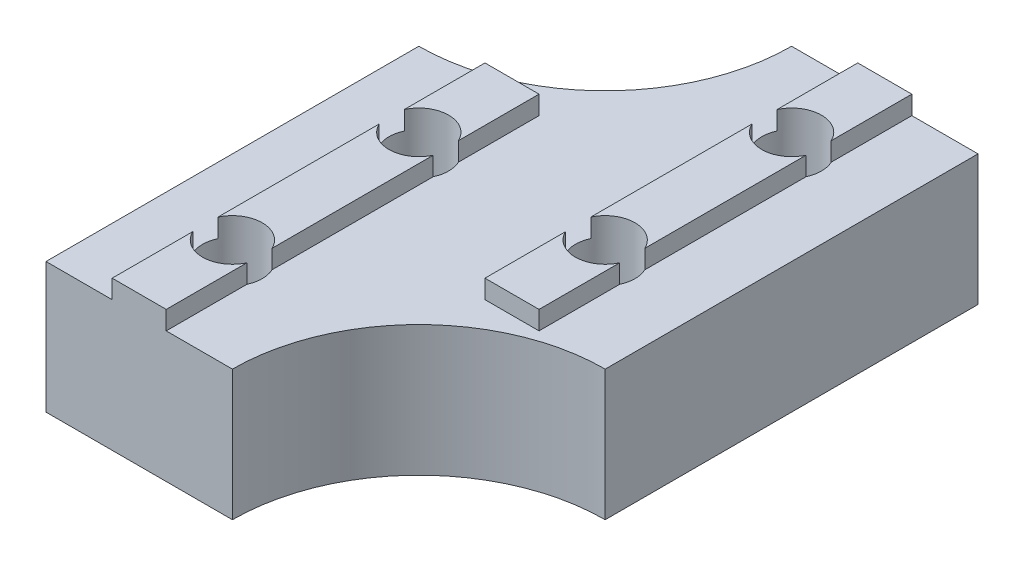
ISO-10303-21;
HEADER;
FILE_DESCRIPTION(('STEP AP214'),'2;1');
FILE_NAME('part.step','',(''),(''),'','','');
FILE_SCHEMA(('AUTOMOTIVE_DESIGN { 1 0 10303 214 1 1 1 1 }'));
ENDSEC;
DATA;
#1=APPLICATION_CONTEXT('core data for automotive mechanical design processes');
#2=APPLICATION_PROTOCOL_DEFINITION('international standard','automotive_design',2000,#1);
#3=PRODUCT_CONTEXT('',#1,'mechanical');
#4=PRODUCT('Part','Part','',(#3));
#5=PRODUCT_RELATED_PRODUCT_CATEGORY('part','',(#4));
#6=PRODUCT_DEFINITION_FORMATION('','',#4);
#7=PRODUCT_DEFINITION_CONTEXT('part definition',#1,'design');
#8=PRODUCT_DEFINITION('design','',#6,#7);
#9=PRODUCT_DEFINITION_SHAPE('','',#8);
#10=(LENGTH_UNIT() NAMED_UNIT(*) SI_UNIT(.MILLI.,.METRE.));
#11=(NAMED_UNIT(*) PLANE_ANGLE_UNIT() SI_UNIT($,.RADIAN.));
#12=(NAMED_UNIT(*) SI_UNIT($,.STERADIAN.) SOLID_ANGLE_UNIT());
#13=UNCERTAINTY_MEASURE_WITH_UNIT(LENGTH_MEASURE(1.E-05),#10,'distance_accuracy_value','');
#14=(GEOMETRIC_REPRESENTATION_CONTEXT(3) GLOBAL_UNCERTAINTY_ASSIGNED_CONTEXT((#13)) GLOBAL_UNIT_ASSIGNED_CONTEXT((#10,
#11,#12)) REPRESENTATION_CONTEXT('',''));
#15=CARTESIAN_POINT('',(0.,0.,0.));
#16=DIRECTION('',(0.,0.,1.));
#17=DIRECTION('',(1.,0.,0.));
#18=AXIS2_PLACEMENT_3D('',#15,#16,#17);
#19=CARTESIAN_POINT('',(-8.55,8.,10.));
#20=DIRECTION('',(-1.,0.,0.));
#21=DIRECTION('',(0.,-1.,0.));
#22=AXIS2_PLACEMENT_3D('',#19,#20,#21);
#23=PLANE('',#22);
#24=DIRECTION('',(0.,0.,-1.));
#25=VECTOR('',#24,1.);
#26=CARTESIAN_POINT('',(-8.55,7.,10.));
#27=LINE('',#26,#25);
#28=CARTESIAN_POINT('',(-8.55,7.,20.));
#29=VERTEX_POINT('',#28);
#30=CARTESIAN_POINT('',(-8.55,7.,15.6763874629234));
#31=VERTEX_POINT('',#30);
#32=EDGE_CURVE('E338',#29,#31,#27,.T.);
#33=ORIENTED_EDGE('',*,*,#32,.T.);
#34=DIRECTION('',(0.,1.,0.));
#35=VECTOR('',#34,1.);
#36=CARTESIAN_POINT('',(-8.55000000000001,0.,15.6763874629234));
#37=LINE('',#36,#35);
#38=CARTESIAN_POINT('',(-8.55,8.,15.6763874629234));
#39=VERTEX_POINT('',#38);
#40=EDGE_CURVE('E474',#31,#39,#37,.T.);
#41=ORIENTED_EDGE('',*,*,#40,.T.);
#42=DIRECTION('',(0.,0.,-1.));
#43=VECTOR('',#42,1.);
#44=CARTESIAN_POINT('',(-8.55,8.,10.));
#45=LINE('',#44,#43);
#46=CARTESIAN_POINT('',(-8.55,8.,20.));
#47=VERTEX_POINT('',#46);
#48=EDGE_CURVE('E333',#47,#39,#45,.T.);
#49=ORIENTED_EDGE('',*,*,#48,.F.);
#50=DIRECTION('',(0.,1.,0.));
#51=VECTOR('',#50,1.);
#52=CARTESIAN_POINT('',(-8.55,8.,20.));
#53=LINE('',#52,#51);
#54=EDGE_CURVE('E477',#29,#47,#53,.T.);
#55=ORIENTED_EDGE('',*,*,#54,.F.);
#56=EDGE_LOOP('',(#33,#41,#49,#55));
#57=FACE_BOUND('',#56,.T.);
#58=ADVANCED_FACE('F33',(#57),#23,.F.);
#59=CARTESIAN_POINT('',(-11.45,8.,10.));
#60=DIRECTION('',(0.,-1.,0.));
#61=DIRECTION('',(1.,0.,0.));
#62=AXIS2_PLACEMENT_3D('',#59,#60,#61);
#63=PLANE('',#62);
#64=ORIENTED_EDGE('',*,*,#48,.T.);
#65=CARTESIAN_POINT('',(-10.,8.,15.));
#66=DIRECTION('',(0.,1.,0.));
#67=DIRECTION('',(0.,0.,1.));
#68=AXIS2_PLACEMENT_3D('',#65,#66,#67);
#69=CIRCLE('',#68,1.6);
#70=CARTESIAN_POINT('',(-11.45,8.,15.6763874629234));
#71=VERTEX_POINT('',#70);
#72=EDGE_CURVE('E452',#71,#39,#69,.T.);
#73=ORIENTED_EDGE('',*,*,#72,.F.);
#74=DIRECTION('',(0.,0.,-1.));
#75=VECTOR('',#74,1.);
#76=CARTESIAN_POINT('',(-11.45,8.,10.));
#77=LINE('',#76,#75);
#78=CARTESIAN_POINT('',(-11.45,8.,20.));
#79=VERTEX_POINT('',#78);
#80=EDGE_CURVE('E328',#79,#71,#77,.T.);
#81=ORIENTED_EDGE('',*,*,#80,.F.);
#82=DIRECTION('',(-1.,0.,0.));
#83=VECTOR('',#82,1.);
#84=CARTESIAN_POINT('',(-11.45,8.,20.));
#85=LINE('',#84,#83);
#86=EDGE_CURVE('E480',#47,#79,#85,.T.);
#87=ORIENTED_EDGE('',*,*,#86,.F.);
#88=EDGE_LOOP('',(#64,#73,#81,#87));
#89=FACE_BOUND('',#88,.T.);
#90=ADVANCED_FACE('F547',(#89),#63,.F.);
#91=CARTESIAN_POINT('',(-11.45,7.,10.));
#92=DIRECTION('',(1.,0.,0.));
#93=DIRECTION('',(0.,0.,-1.));
#94=AXIS2_PLACEMENT_3D('',#91,#92,#93);
#95=PLANE('',#94);
#96=DIRECTION('',(0.,0.,-1.));
#97=VECTOR('',#96,1.);
#98=CARTESIAN_POINT('',(-11.45,7.,10.));
#99=LINE('',#98,#97);
#100=CARTESIAN_POINT('',(-11.45,7.,14.3236125370766));
#101=VERTEX_POINT('',#100);
#102=CARTESIAN_POINT('',(-11.45,7.,5.67638746292344));
#103=VERTEX_POINT('',#102);
#104=EDGE_CURVE('E327',#101,#103,#99,.T.);
#105=ORIENTED_EDGE('',*,*,#104,.F.);
#106=DIRECTION('',(0.,1.,0.));
#107=VECTOR('',#106,1.);
#108=CARTESIAN_POINT('',(-11.45,0.,14.3236125370766));
#109=LINE('',#108,#107);
#110=CARTESIAN_POINT('',(-11.45,8.,14.3236125370766));
#111=VERTEX_POINT('',#110);
#112=EDGE_CURVE('E56',#101,#111,#109,.T.);
#113=ORIENTED_EDGE('',*,*,#112,.T.);
#114=CARTESIAN_POINT('',(-11.45,8.,5.67638746292344));
#115=VERTEX_POINT('',#114);
#116=EDGE_CURVE('E332',#111,#115,#77,.T.);
#117=ORIENTED_EDGE('',*,*,#116,.T.);
#118=DIRECTION('',(0.,1.,0.));
#119=VECTOR('',#118,1.);
#120=CARTESIAN_POINT('',(-11.45,0.,5.67638746292344));
#121=LINE('',#120,#119);
#122=EDGE_CURVE('E500',#115,#103,#121,.F.);
#123=ORIENTED_EDGE('',*,*,#122,.T.);
#124=EDGE_LOOP('',(#105,#113,#117,#123));
#125=FACE_BOUND('',#124,.T.);
#126=ADVANCED_FACE('F564',(#125),#95,.F.);
#127=CARTESIAN_POINT('',(-8.55,8.,14.3236125370766));
#128=VERTEX_POINT('',#127);
#129=CARTESIAN_POINT('',(-8.55,8.,5.67638746292344));
#130=VERTEX_POINT('',#129);
#131=EDGE_CURVE('E337',#128,#130,#45,.T.);
#132=ORIENTED_EDGE('',*,*,#131,.F.);
#133=DIRECTION('',(0.,1.,0.));
#134=VECTOR('',#133,1.);
#135=CARTESIAN_POINT('',(-8.55000000000001,0.,14.3236125370766));
#136=LINE('',#135,#134);
#137=CARTESIAN_POINT('',(-8.55,7.,14.3236125370766));
#138=VERTEX_POINT('',#137);
#139=EDGE_CURVE('E471',#128,#138,#136,.F.);
#140=ORIENTED_EDGE('',*,*,#139,.T.);
#141=CARTESIAN_POINT('',(-8.55,7.,5.67638746292344));
#142=VERTEX_POINT('',#141);
#143=EDGE_CURVE('E342',#138,#142,#27,.T.);
#144=ORIENTED_EDGE('',*,*,#143,.T.);
#145=DIRECTION('',(0.,1.,0.));
#146=VECTOR('',#145,1.);
#147=CARTESIAN_POINT('',(-8.55000000000001,0.,5.67638746292345));
#148=LINE('',#147,#146);
#149=EDGE_CURVE('E392',#142,#130,#148,.T.);
#150=ORIENTED_EDGE('',*,*,#149,.T.);
#151=EDGE_LOOP('',(#132,#140,#144,#150));
#152=FACE_BOUND('',#151,.T.);
#153=ADVANCED_FACE('F538',(#152),#23,.F.);
#154=ORIENTED_EDGE('',*,*,#116,.F.);
#155=EDGE_CURVE('E454',#128,#111,#69,.T.);
#156=ORIENTED_EDGE('',*,*,#155,.F.);
#157=ORIENTED_EDGE('',*,*,#131,.T.);
#158=CARTESIAN_POINT('',(-10.,8.,5.));
#159=DIRECTION('',(0.,1.,0.));
#160=DIRECTION('',(0.,0.,1.));
#161=AXIS2_PLACEMENT_3D('',#158,#159,#160);
#162=CIRCLE('',#161,1.6);
#163=EDGE_CURVE('E496',#115,#130,#162,.T.);
#164=ORIENTED_EDGE('',*,*,#163,.F.);
#165=EDGE_LOOP('',(#154,#156,#157,#164));
#166=FACE_BOUND('',#165,.T.);
#167=ADVANCED_FACE('F534',(#166),#63,.F.);
#168=CARTESIAN_POINT('',(-11.45,8.,4.32361253707657));
#169=VERTEX_POINT('',#168);
#170=CARTESIAN_POINT('',(-11.45,8.,0.));
#171=VERTEX_POINT('',#170);
#172=EDGE_CURVE('E326',#169,#171,#77,.T.);
#173=ORIENTED_EDGE('',*,*,#172,.T.);
#174=DIRECTION('',(0.,-1.,0.));
#175=VECTOR('',#174,1.);
#176=CARTESIAN_POINT('',(-11.45,7.,0.));
#177=LINE('',#176,#175);
#178=CARTESIAN_POINT('',(-11.45,7.,0.));
#179=VERTEX_POINT('',#178);
#180=EDGE_CURVE('E456',#171,#179,#177,.T.);
#181=ORIENTED_EDGE('',*,*,#180,.T.);
#182=CARTESIAN_POINT('',(-11.45,7.,4.32361253707657));
#183=VERTEX_POINT('',#182);
#184=EDGE_CURVE('E322',#183,#179,#99,.T.);
#185=ORIENTED_EDGE('',*,*,#184,.F.);
#186=DIRECTION('',(0.,1.,0.));
#187=VECTOR('',#186,1.);
#188=CARTESIAN_POINT('',(-11.45,0.,4.32361253707657));
#189=LINE('',#188,#187);
#190=EDGE_CURVE('E506',#183,#169,#189,.T.);
#191=ORIENTED_EDGE('',*,*,#190,.T.);
#192=EDGE_LOOP('',(#173,#181,#185,#191));
#193=FACE_BOUND('',#192,.T.);
#194=ADVANCED_FACE('F565',(#193),#95,.F.);
#195=CARTESIAN_POINT('',(1.45,8.,10.));
#196=DIRECTION('',(-1.,0.,0.));
#197=DIRECTION('',(0.,-1.,0.));
#198=AXIS2_PLACEMENT_3D('',#195,#196,#197);
#199=PLANE('',#198);
#200=DIRECTION('',(0.,0.,-1.));
#201=VECTOR('',#200,1.);
#202=CARTESIAN_POINT('',(1.45,8.,10.));
#203=LINE('',#202,#201);
#204=CARTESIAN_POINT('',(1.45,7.99999999999999,10.));
#205=VERTEX_POINT('',#204);
#206=CARTESIAN_POINT('',(1.45,8.,5.67638746292344));
#207=VERTEX_POINT('',#206);
#208=EDGE_CURVE('E247',#205,#207,#203,.T.);
#209=ORIENTED_EDGE('',*,*,#208,.F.);
#210=DIRECTION('',(0.,-1.,0.));
#211=VECTOR('',#210,1.);
#212=CARTESIAN_POINT('',(1.45,8.,10.));
#213=LINE('',#212,#211);
#214=CARTESIAN_POINT('',(1.44999999999999,7.,10.));
#215=VERTEX_POINT('',#214);
#216=EDGE_CURVE('E232',#205,#215,#213,.T.);
#217=ORIENTED_EDGE('',*,*,#216,.T.);
#218=DIRECTION('',(0.,0.,-1.));
#219=VECTOR('',#218,1.);
#220=CARTESIAN_POINT('',(1.45,7.,10.));
#221=LINE('',#220,#219);
#222=CARTESIAN_POINT('',(1.45,7.,5.67638746292344));
#223=VERTEX_POINT('',#222);
#224=EDGE_CURVE('E245',#215,#223,#221,.T.);
#225=ORIENTED_EDGE('',*,*,#224,.T.);
#226=DIRECTION('',(0.,1.,0.));
#227=VECTOR('',#226,1.);
#228=CARTESIAN_POINT('',(1.44999999999999,0.,5.67638746292345));
#229=LINE('',#228,#227);
#230=EDGE_CURVE('E359',#223,#207,#229,.T.);
#231=ORIENTED_EDGE('',*,*,#230,.T.);
#232=EDGE_LOOP('',(#209,#217,#225,#231));
#233=FACE_BOUND('',#232,.T.);
#234=ADVANCED_FACE('F243',(#233),#199,.F.);
#235=CARTESIAN_POINT('',(-1.45,8.,10.));
#236=DIRECTION('',(0.,-1.,0.));
#237=DIRECTION('',(1.,0.,0.));
#238=AXIS2_PLACEMENT_3D('',#235,#236,#237);
#239=PLANE('',#238);
#240=DIRECTION('',(0.,0.,-1.));
#241=VECTOR('',#240,1.);
#242=CARTESIAN_POINT('',(-1.45,8.,10.));
#243=LINE('',#242,#241);
#244=CARTESIAN_POINT('',(-1.45,7.99999999999999,10.));
#245=VERTEX_POINT('',#244);
#246=CARTESIAN_POINT('',(-1.45,8.,5.67638746292344));
#247=VERTEX_POINT('',#246);
#248=EDGE_CURVE('E364',#245,#247,#243,.T.);
#249=ORIENTED_EDGE('',*,*,#248,.F.);
#250=DIRECTION('',(-1.,0.,0.));
#251=VECTOR('',#250,1.);
#252=CARTESIAN_POINT('',(5.,7.99999999999999,10.));
#253=LINE('',#252,#251);
#254=EDGE_CURVE('E239',#205,#245,#253,.T.);
#255=ORIENTED_EDGE('',*,*,#254,.F.);
#256=ORIENTED_EDGE('',*,*,#208,.T.);
#257=CARTESIAN_POINT('',(0.,8.,5.));
#258=DIRECTION('',(0.,1.,0.));
#259=DIRECTION('',(0.,0.,1.));
#260=AXIS2_PLACEMENT_3D('',#257,#258,#259);
#261=CIRCLE('',#260,1.6);
#262=EDGE_CURVE('E341',#247,#207,#261,.T.);
#263=ORIENTED_EDGE('',*,*,#262,.F.);
#264=EDGE_LOOP('',(#249,#255,#256,#263));
#265=FACE_BOUND('',#264,.T.);
#266=ADVANCED_FACE('F431',(#265),#239,.F.);
#267=CARTESIAN_POINT('',(-1.45,7.,10.));
#268=DIRECTION('',(1.,0.,0.));
#269=DIRECTION('',(0.,0.,-1.));
#270=AXIS2_PLACEMENT_3D('',#267,#268,#269);
#271=PLANE('',#270);
#272=DIRECTION('',(0.,0.,-1.));
#273=VECTOR('',#272,1.);
#274=CARTESIAN_POINT('',(-1.45,7.,10.));
#275=LINE('',#274,#273);
#276=CARTESIAN_POINT('',(-1.45,7.,4.32361253707657));
#277=VERTEX_POINT('',#276);
#278=CARTESIAN_POINT('',(-1.45,7.,-4.32361253707656));
#279=VERTEX_POINT('',#278);
#280=EDGE_CURVE('E361',#277,#279,#275,.T.);
#281=ORIENTED_EDGE('',*,*,#280,.F.);
#282=DIRECTION('',(0.,1.,0.));
#283=VECTOR('',#282,1.);
#284=CARTESIAN_POINT('',(-1.45,0.,4.32361253707657));
#285=LINE('',#284,#283);
#286=CARTESIAN_POINT('',(-1.45,8.,4.32361253707657));
#287=VERTEX_POINT('',#286);
#288=EDGE_CURVE('E352',#277,#287,#285,.T.);
#289=ORIENTED_EDGE('',*,*,#288,.T.);
#290=CARTESIAN_POINT('',(-1.45,8.,-4.32361253707656));
#291=VERTEX_POINT('',#290);
#292=EDGE_CURVE('E363',#287,#291,#243,.T.);
#293=ORIENTED_EDGE('',*,*,#292,.T.);
#294=DIRECTION('',(0.,1.,0.));
#295=VECTOR('',#294,1.);
#296=CARTESIAN_POINT('',(-1.45,0.,-4.32361253707656));
#297=LINE('',#296,#295);
#298=EDGE_CURVE('E375',#291,#279,#297,.F.);
#299=ORIENTED_EDGE('',*,*,#298,.T.);
#300=EDGE_LOOP('',(#281,#289,#293,#299));
#301=FACE_BOUND('',#300,.T.);
#302=ADVANCED_FACE('F374',(#301),#271,.F.);
#303=CARTESIAN_POINT('',(5.,0.,10.));
#304=DIRECTION('',(0.,1.,0.));
#305=DIRECTION('',(-1.,0.,0.));
#306=AXIS2_PLACEMENT_3D('',#303,#304,#305);
#307=PLANE('',#306);
#308=CARTESIAN_POINT('',(-10.,0.,15.));
#309=DIRECTION('',(0.,1.,0.));
#310=DIRECTION('',(0.,0.,1.));
#311=AXIS2_PLACEMENT_3D('',#308,#309,#310);
#312=CIRCLE('',#311,1.6);
#313=CARTESIAN_POINT('',(-10.,0.,16.6));
#314=VERTEX_POINT('',#313);
#315=EDGE_CURVE('E461',#314,#314,#312,.T.);
#316=ORIENTED_EDGE('',*,*,#315,.T.);
#317=EDGE_LOOP('',(#316));
#318=FACE_BOUND('',#317,.T.);
#319=CARTESIAN_POINT('',(-10.,0.,5.));
#320=DIRECTION('',(0.,1.,0.));
#321=DIRECTION('',(0.,0.,1.));
#322=AXIS2_PLACEMENT_3D('',#319,#320,#321);
#323=CIRCLE('',#322,1.6);
#324=CARTESIAN_POINT('',(-10.,0.,6.6));
#325=VERTEX_POINT('',#324);
#326=EDGE_CURVE('E497',#325,#325,#323,.T.);
#327=ORIENTED_EDGE('',*,*,#326,.T.);
#328=EDGE_LOOP('',(#327));
#329=FACE_BOUND('',#328,.T.);
#330=CARTESIAN_POINT('',(0.,0.,5.));
#331=DIRECTION('',(0.,1.,0.));
#332=DIRECTION('',(0.,0.,1.));
#333=AXIS2_PLACEMENT_3D('',#330,#331,#332);
#334=CIRCLE('',#333,1.6);
#335=CARTESIAN_POINT('',(0.,0.,6.6));
#336=VERTEX_POINT('',#335);
#337=EDGE_CURVE('E343',#336,#336,#334,.T.);
#338=ORIENTED_EDGE('',*,*,#337,.T.);
#339=EDGE_LOOP('',(#338));
#340=FACE_BOUND('',#339,.T.);
#341=DIRECTION('',(0.,0.,-1.));
#342=VECTOR('',#341,1.);
#343=CARTESIAN_POINT('',(5.,0.,10.));
#344=LINE('',#343,#342);
#345=CARTESIAN_POINT('',(5.,0.,10.));
#346=VERTEX_POINT('',#345);
#347=CARTESIAN_POINT('',(5.,0.,-10.));
#348=VERTEX_POINT('',#347);
#349=EDGE_CURVE('E257',#346,#348,#344,.T.);
#350=ORIENTED_EDGE('',*,*,#349,.F.);
#351=CARTESIAN_POINT('',(4.99999999999999,0.,20.));
#352=DIRECTION('',(0.,1.,0.));
#353=DIRECTION('',(-1.,0.,0.));
#354=AXIS2_PLACEMENT_3D('',#351,#352,#353);
#355=CIRCLE('',#354,10.);
#356=CARTESIAN_POINT('',(-5.00000000000001,0.,20.));
#357=VERTEX_POINT('',#356);
#358=EDGE_CURVE('E272',#346,#357,#355,.T.);
#359=ORIENTED_EDGE('',*,*,#358,.T.);
#360=DIRECTION('',(1.,0.,0.));
#361=VECTOR('',#360,1.);
#362=CARTESIAN_POINT('',(5.,0.,20.));
#363=LINE('',#362,#361);
#364=CARTESIAN_POINT('',(-15.,0.,20.));
#365=VERTEX_POINT('',#364);
#366=EDGE_CURVE('E492',#365,#357,#363,.T.);
#367=ORIENTED_EDGE('',*,*,#366,.F.);
#368=DIRECTION('',(0.,0.,-1.));
#369=VECTOR('',#368,1.);
#370=CARTESIAN_POINT('',(-15.,0.,10.));
#371=LINE('',#370,#369);
#372=CARTESIAN_POINT('',(-15.,0.,0.));
#373=VERTEX_POINT('',#372);
#374=EDGE_CURVE('E282',#365,#373,#371,.T.);
#375=ORIENTED_EDGE('',*,*,#374,.T.);
#376=CARTESIAN_POINT('',(-15.,0.,-10.));
#377=DIRECTION('',(0.,1.,0.));
#378=DIRECTION('',(-1.,0.,0.));
#379=AXIS2_PLACEMENT_3D('',#376,#377,#378);
#380=CIRCLE('',#379,10.);
#381=CARTESIAN_POINT('',(-5.,0.,-10.));
#382=VERTEX_POINT('',#381);
#383=EDGE_CURVE('E41',#373,#382,#380,.T.);
#384=ORIENTED_EDGE('',*,*,#383,.T.);
#385=DIRECTION('',(1.,0.,0.));
#386=VECTOR('',#385,1.);
#387=CARTESIAN_POINT('',(5.,0.,-10.));
#388=LINE('',#387,#386);
#389=EDGE_CURVE('E280',#382,#348,#388,.T.);
#390=ORIENTED_EDGE('',*,*,#389,.T.);
#391=EDGE_LOOP('',(#350,#359,#367,#375,#384,#390));
#392=FACE_BOUND('',#391,.T.);
#393=CARTESIAN_POINT('',(0.,0.,-5.));
#394=DIRECTION('',(0.,1.,0.));
#395=DIRECTION('',(0.,0.,1.));
#396=AXIS2_PLACEMENT_3D('',#393,#394,#395);
#397=CIRCLE('',#396,1.6);
#398=CARTESIAN_POINT('',(0.,0.,-3.4));
#399=VERTEX_POINT('',#398);
#400=EDGE_CURVE('E387',#399,#399,#397,.T.);
#401=ORIENTED_EDGE('',*,*,#400,.T.);
#402=EDGE_LOOP('',(#401));
#403=FACE_BOUND('',#402,.T.);
#404=ADVANCED_FACE('F278',(#318,#329,#340,#392,#403),#307,.F.);
#405=CARTESIAN_POINT('',(5.,7.,10.));
#406=DIRECTION('',(-1.,0.,0.));
#407=DIRECTION('',(0.,-1.,0.));
#408=AXIS2_PLACEMENT_3D('',#405,#406,#407);
#409=PLANE('',#408);
#410=DIRECTION('',(0.,0.,-1.));
#411=VECTOR('',#410,1.);
#412=CARTESIAN_POINT('',(5.,7.,10.));
#413=LINE('',#412,#411);
#414=CARTESIAN_POINT('',(5.,7.,10.));
#415=VERTEX_POINT('',#414);
#416=CARTESIAN_POINT('',(5.,7.,-10.));
#417=VERTEX_POINT('',#416);
#418=EDGE_CURVE('E254',#415,#417,#413,.T.);
#419=ORIENTED_EDGE('',*,*,#418,.F.);
#420=DIRECTION('',(0.,1.,0.));
#421=VECTOR('',#420,1.);
#422=CARTESIAN_POINT('',(5.,0.,10.));
#423=LINE('',#422,#421);
#424=EDGE_CURVE('E446',#346,#415,#423,.T.);
#425=ORIENTED_EDGE('',*,*,#424,.F.);
#426=ORIENTED_EDGE('',*,*,#349,.T.);
#427=DIRECTION('',(0.,1.,0.));
#428=VECTOR('',#427,1.);
#429=CARTESIAN_POINT('',(5.,7.,-10.));
#430=LINE('',#429,#428);
#431=EDGE_CURVE('E296',#348,#417,#430,.T.);
#432=ORIENTED_EDGE('',*,*,#431,.T.);
#433=EDGE_LOOP('',(#419,#425,#426,#432));
#434=FACE_BOUND('',#433,.T.);
#435=ADVANCED_FACE('F445',(#434),#409,.F.);
#436=CARTESIAN_POINT('',(1.45,8.,4.32361253707656));
#437=VERTEX_POINT('',#436);
#438=CARTESIAN_POINT('',(1.45,8.,-4.32361253707656));
#439=VERTEX_POINT('',#438);
#440=EDGE_CURVE('E365',#437,#439,#203,.T.);
#441=ORIENTED_EDGE('',*,*,#440,.F.);
#442=DIRECTION('',(0.,1.,0.));
#443=VECTOR('',#442,1.);
#444=CARTESIAN_POINT('',(1.44999999999999,0.,4.32361253707655));
#445=LINE('',#444,#443);
#446=CARTESIAN_POINT('',(1.44999999999999,7.,4.32361253707655));
#447=VERTEX_POINT('',#446);
#448=EDGE_CURVE('E355',#437,#447,#445,.F.);
#449=ORIENTED_EDGE('',*,*,#448,.T.);
#450=CARTESIAN_POINT('',(1.45,7.,-4.32361253707656));
#451=VERTEX_POINT('',#450);
#452=EDGE_CURVE('E255',#447,#451,#221,.T.);
#453=ORIENTED_EDGE('',*,*,#452,.T.);
#454=DIRECTION('',(0.,1.,0.));
#455=VECTOR('',#454,1.);
#456=CARTESIAN_POINT('',(1.44999999999999,0.,-4.32361253707655));
#457=LINE('',#456,#455);
#458=EDGE_CURVE('E297',#451,#439,#457,.T.);
#459=ORIENTED_EDGE('',*,*,#458,.T.);
#460=EDGE_LOOP('',(#441,#449,#453,#459));
#461=FACE_BOUND('',#460,.T.);
#462=ADVANCED_FACE('F433',(#461),#199,.F.);
#463=ORIENTED_EDGE('',*,*,#292,.F.);
#464=EDGE_CURVE('E347',#437,#287,#261,.T.);
#465=ORIENTED_EDGE('',*,*,#464,.F.);
#466=ORIENTED_EDGE('',*,*,#440,.T.);
#467=CARTESIAN_POINT('',(0.,8.,-5.));
#468=DIRECTION('',(0.,1.,0.));
#469=DIRECTION('',(0.,0.,1.));
#470=AXIS2_PLACEMENT_3D('',#467,#468,#469);
#471=CIRCLE('',#470,1.6);
#472=EDGE_CURVE('E384',#291,#439,#471,.T.);
#473=ORIENTED_EDGE('',*,*,#472,.F.);
#474=EDGE_LOOP('',(#463,#465,#466,#473));
#475=FACE_BOUND('',#474,.T.);
#476=ADVANCED_FACE('F389',(#475),#239,.F.);
#477=CARTESIAN_POINT('',(-1.45,7.,10.));
#478=VERTEX_POINT('',#477);
#479=CARTESIAN_POINT('',(-1.45,7.,5.67638746292344));
#480=VERTEX_POINT('',#479);
#481=EDGE_CURVE('E362',#478,#480,#275,.T.);
#482=ORIENTED_EDGE('',*,*,#481,.F.);
#483=DIRECTION('',(0.,1.,0.));
#484=VECTOR('',#483,1.);
#485=CARTESIAN_POINT('',(-1.45,7.,10.));
#486=LINE('',#485,#484);
#487=EDGE_CURVE('E235',#478,#245,#486,.T.);
#488=ORIENTED_EDGE('',*,*,#487,.T.);
#489=ORIENTED_EDGE('',*,*,#248,.T.);
#490=DIRECTION('',(0.,1.,0.));
#491=VECTOR('',#490,1.);
#492=CARTESIAN_POINT('',(-1.45,0.,5.67638746292344));
#493=LINE('',#492,#491);
#494=EDGE_CURVE('E346',#247,#480,#493,.F.);
#495=ORIENTED_EDGE('',*,*,#494,.T.);
#496=EDGE_LOOP('',(#482,#488,#489,#495));
#497=FACE_BOUND('',#496,.T.);
#498=ADVANCED_FACE('F428',(#497),#271,.F.);
#499=CARTESIAN_POINT('',(-5.,7.,10.));
#500=DIRECTION('',(0.,-1.,0.));
#501=DIRECTION('',(0.,0.,-1.));
#502=AXIS2_PLACEMENT_3D('',#499,#500,#501);
#503=PLANE('',#502);
#504=CARTESIAN_POINT('',(5.,7.,20.));
#505=DIRECTION('',(0.,-1.,0.));
#506=DIRECTION('',(0.,0.,-1.));
#507=AXIS2_PLACEMENT_3D('',#504,#505,#506);
#508=CIRCLE('',#507,10.);
#509=CARTESIAN_POINT('',(-5.,7.,20.));
#510=VERTEX_POINT('',#509);
#511=EDGE_CURVE('E48',#510,#415,#508,.T.);
#512=ORIENTED_EDGE('',*,*,#511,.T.);
#513=ORIENTED_EDGE('',*,*,#418,.T.);
#514=DIRECTION('',(-1.,0.,0.));
#515=VECTOR('',#514,1.);
#516=CARTESIAN_POINT('',(1.45,7.,-10.));
#517=LINE('',#516,#515);
#518=CARTESIAN_POINT('',(1.45,7.,-10.));
#519=VERTEX_POINT('',#518);
#520=EDGE_CURVE('E409',#417,#519,#517,.T.);
#521=ORIENTED_EDGE('',*,*,#520,.T.);
#522=DIRECTION('',(0.,0.,-1.));
#523=VECTOR('',#522,1.);
#524=CARTESIAN_POINT('',(1.45,7.,0.));
#525=LINE('',#524,#523);
#526=CARTESIAN_POINT('',(1.44999999999999,7.,-5.67638746292345));
#527=VERTEX_POINT('',#526);
#528=EDGE_CURVE('E311',#527,#519,#525,.T.);
#529=ORIENTED_EDGE('',*,*,#528,.F.);
#530=CARTESIAN_POINT('',(0.,7.,-5.));
#531=DIRECTION('',(0.,-1.,0.));
#532=DIRECTION('',(0.,0.,-1.));
#533=AXIS2_PLACEMENT_3D('',#530,#531,#532);
#534=CIRCLE('',#533,1.6);
#535=EDGE_CURVE('E404',#527,#451,#534,.T.);
#536=ORIENTED_EDGE('',*,*,#535,.T.);
#537=ORIENTED_EDGE('',*,*,#452,.F.);
#538=CARTESIAN_POINT('',(0.,7.,5.));
#539=DIRECTION('',(0.,-1.,0.));
#540=DIRECTION('',(0.,0.,-1.));
#541=AXIS2_PLACEMENT_3D('',#538,#539,#540);
#542=CIRCLE('',#541,1.6);
#543=EDGE_CURVE('E253',#447,#223,#542,.T.);
#544=ORIENTED_EDGE('',*,*,#543,.T.);
#545=ORIENTED_EDGE('',*,*,#224,.F.);
#546=DIRECTION('',(-1.,0.,0.));
#547=VECTOR('',#546,1.);
#548=CARTESIAN_POINT('',(4.99999999999999,7.,10.));
#549=LINE('',#548,#547);
#550=EDGE_CURVE('E229',#215,#478,#549,.T.);
#551=ORIENTED_EDGE('',*,*,#550,.T.);
#552=ORIENTED_EDGE('',*,*,#481,.T.);
#553=CARTESIAN_POINT('',(0.,7.,5.));
#554=DIRECTION('',(0.,-1.,0.));
#555=DIRECTION('',(0.,0.,-1.));
#556=AXIS2_PLACEMENT_3D('',#553,#554,#555);
#557=CIRCLE('',#556,1.6);
#558=EDGE_CURVE('E263',#480,#277,#557,.T.);
#559=ORIENTED_EDGE('',*,*,#558,.T.);
#560=ORIENTED_EDGE('',*,*,#280,.T.);
#561=CARTESIAN_POINT('',(0.,7.,-5.));
#562=DIRECTION('',(0.,-1.,0.));
#563=DIRECTION('',(0.,0.,-1.));
#564=AXIS2_PLACEMENT_3D('',#561,#562,#563);
#565=CIRCLE('',#564,1.6);
#566=CARTESIAN_POINT('',(-1.45,7.,-5.67638746292343));
#567=VERTEX_POINT('',#566);
#568=EDGE_CURVE('E313',#279,#567,#565,.T.);
#569=ORIENTED_EDGE('',*,*,#568,.T.);
#570=DIRECTION('',(0.,0.,-1.));
#571=VECTOR('',#570,1.);
#572=CARTESIAN_POINT('',(-1.45,7.,0.));
#573=LINE('',#572,#571);
#574=CARTESIAN_POINT('',(-1.45,7.,-10.));
#575=VERTEX_POINT('',#574);
#576=EDGE_CURVE('E299',#567,#575,#573,.T.);
#577=ORIENTED_EDGE('',*,*,#576,.T.);
#578=DIRECTION('',(-1.,0.,0.));
#579=VECTOR('',#578,1.);
#580=CARTESIAN_POINT('',(-5.,7.,-10.));
#581=LINE('',#580,#579);
#582=CARTESIAN_POINT('',(-5.,7.,-10.));
#583=VERTEX_POINT('',#582);
#584=EDGE_CURVE('E300',#575,#583,#581,.T.);
#585=ORIENTED_EDGE('',*,*,#584,.T.);
#586=CARTESIAN_POINT('',(-15.,7.,-10.));
#587=DIRECTION('',(0.,-1.,0.));
#588=DIRECTION('',(0.,0.,-1.));
#589=AXIS2_PLACEMENT_3D('',#586,#587,#588);
#590=CIRCLE('',#589,10.);
#591=CARTESIAN_POINT('',(-15.,7.,0.));
#592=VERTEX_POINT('',#591);
#593=EDGE_CURVE('E11',#583,#592,#590,.T.);
#594=ORIENTED_EDGE('',*,*,#593,.T.);
#595=DIRECTION('',(0.,0.,-1.));
#596=VECTOR('',#595,1.);
#597=CARTESIAN_POINT('',(-15.,7.,10.));
#598=LINE('',#597,#596);
#599=CARTESIAN_POINT('',(-15.,7.,20.));
#600=VERTEX_POINT('',#599);
#601=EDGE_CURVE('E319',#600,#592,#598,.T.);
#602=ORIENTED_EDGE('',*,*,#601,.F.);
#603=DIRECTION('',(-1.,0.,0.));
#604=VECTOR('',#603,1.);
#605=CARTESIAN_POINT('',(-15.,7.,20.));
#606=LINE('',#605,#604);
#607=CARTESIAN_POINT('',(-11.45,7.,20.));
#608=VERTEX_POINT('',#607);
#609=EDGE_CURVE('E486',#608,#600,#606,.T.);
#610=ORIENTED_EDGE('',*,*,#609,.F.);
#611=CARTESIAN_POINT('',(-11.45,7.,15.6763874629234));
#612=VERTEX_POINT('',#611);
#613=EDGE_CURVE('E323',#608,#612,#99,.T.);
#614=ORIENTED_EDGE('',*,*,#613,.T.);
#615=CARTESIAN_POINT('',(-10.,7.,15.));
#616=DIRECTION('',(0.,-1.,0.));
#617=DIRECTION('',(0.,0.,-1.));
#618=AXIS2_PLACEMENT_3D('',#615,#616,#617);
#619=CIRCLE('',#618,1.6);
#620=EDGE_CURVE('E269',#612,#101,#619,.T.);
#621=ORIENTED_EDGE('',*,*,#620,.T.);
#622=ORIENTED_EDGE('',*,*,#104,.T.);
#623=CARTESIAN_POINT('',(-10.,7.,5.));
#624=DIRECTION('',(0.,-1.,0.));
#625=DIRECTION('',(0.,0.,-1.));
#626=AXIS2_PLACEMENT_3D('',#623,#624,#625);
#627=CIRCLE('',#626,1.6);
#628=EDGE_CURVE('E266',#103,#183,#627,.T.);
#629=ORIENTED_EDGE('',*,*,#628,.T.);
#630=ORIENTED_EDGE('',*,*,#184,.T.);
#631=DIRECTION('',(1.,0.,0.));
#632=VECTOR('',#631,1.);
#633=CARTESIAN_POINT('',(-5.00000000000001,7.,0.));
#634=LINE('',#633,#632);
#635=CARTESIAN_POINT('',(-8.55,7.,0.));
#636=VERTEX_POINT('',#635);
#637=EDGE_CURVE('E741',#179,#636,#634,.T.);
#638=ORIENTED_EDGE('',*,*,#637,.T.);
#639=CARTESIAN_POINT('',(-8.55000000000001,7.,4.32361253707655));
#640=VERTEX_POINT('',#639);
#641=EDGE_CURVE('E336',#640,#636,#27,.T.);
#642=ORIENTED_EDGE('',*,*,#641,.F.);
#643=CARTESIAN_POINT('',(-10.,7.,5.));
#644=DIRECTION('',(0.,-1.,0.));
#645=DIRECTION('',(0.,0.,-1.));
#646=AXIS2_PLACEMENT_3D('',#643,#644,#645);
#647=CIRCLE('',#646,1.6);
#648=EDGE_CURVE('E395',#640,#142,#647,.T.);
#649=ORIENTED_EDGE('',*,*,#648,.T.);
#650=ORIENTED_EDGE('',*,*,#143,.F.);
#651=CARTESIAN_POINT('',(-10.,7.,15.));
#652=DIRECTION('',(0.,-1.,0.));
#653=DIRECTION('',(0.,0.,-1.));
#654=AXIS2_PLACEMENT_3D('',#651,#652,#653);
#655=CIRCLE('',#654,1.6);
#656=EDGE_CURVE('E468',#138,#31,#655,.T.);
#657=ORIENTED_EDGE('',*,*,#656,.T.);
#658=ORIENTED_EDGE('',*,*,#32,.F.);
#659=DIRECTION('',(-1.,0.,0.));
#660=VECTOR('',#659,1.);
#661=CARTESIAN_POINT('',(-5.,7.,20.));
#662=LINE('',#661,#660);
#663=EDGE_CURVE('E494',#510,#29,#662,.T.);
#664=ORIENTED_EDGE('',*,*,#663,.F.);
#665=EDGE_LOOP('',(#512,#513,#521,#529,#536,#537,#544,#545,#551,#552,#559,#560,#569,#577,#585,
#594,#602,#610,#614,#621,#622,#629,#630,#638,#642,#649,#650,#657,#658,#664));
#666=FACE_BOUND('',#665,.T.);
#667=ADVANCED_FACE('F251',(#666),#503,.F.);
#668=CARTESIAN_POINT('',(0.,0.,5.));
#669=DIRECTION('',(0.,1.,0.));
#670=DIRECTION('',(0.,0.,1.));
#671=AXIS2_PLACEMENT_3D('',#668,#669,#670);
#672=CYLINDRICAL_SURFACE('',#671,1.6);
#673=ORIENTED_EDGE('',*,*,#337,.F.);
#674=EDGE_LOOP('',(#673));
#675=FACE_BOUND('',#674,.T.);
#676=ORIENTED_EDGE('',*,*,#543,.F.);
#677=ORIENTED_EDGE('',*,*,#448,.F.);
#678=ORIENTED_EDGE('',*,*,#464,.T.);
#679=ORIENTED_EDGE('',*,*,#288,.F.);
#680=ORIENTED_EDGE('',*,*,#558,.F.);
#681=ORIENTED_EDGE('',*,*,#494,.F.);
#682=ORIENTED_EDGE('',*,*,#262,.T.);
#683=ORIENTED_EDGE('',*,*,#230,.F.);
#684=EDGE_LOOP('',(#676,#677,#678,#679,#680,#681,#682,#683));
#685=FACE_BOUND('',#684,.T.);
#686=ADVANCED_FACE('F426',(#675,#685),#672,.F.);
#687=ORIENTED_EDGE('',*,*,#641,.T.);
#688=DIRECTION('',(0.,1.,0.));
#689=VECTOR('',#688,1.);
#690=CARTESIAN_POINT('',(-8.55,8.,0.));
#691=LINE('',#690,#689);
#692=CARTESIAN_POINT('',(-8.55,8.,0.));
#693=VERTEX_POINT('',#692);
#694=EDGE_CURVE('E526',#636,#693,#691,.T.);
#695=ORIENTED_EDGE('',*,*,#694,.T.);
#696=CARTESIAN_POINT('',(-8.55,8.,4.32361253707657));
#697=VERTEX_POINT('',#696);
#698=EDGE_CURVE('E331',#697,#693,#45,.T.);
#699=ORIENTED_EDGE('',*,*,#698,.F.);
#700=DIRECTION('',(0.,1.,0.));
#701=VECTOR('',#700,1.);
#702=CARTESIAN_POINT('',(-8.55000000000001,0.,4.32361253707655));
#703=LINE('',#702,#701);
#704=EDGE_CURVE('E509',#697,#640,#703,.F.);
#705=ORIENTED_EDGE('',*,*,#704,.T.);
#706=EDGE_LOOP('',(#687,#695,#699,#705));
#707=FACE_BOUND('',#706,.T.);
#708=ADVANCED_FACE('F523',(#707),#23,.F.);
#709=ORIENTED_EDGE('',*,*,#698,.T.);
#710=DIRECTION('',(1.,0.,0.));
#711=VECTOR('',#710,1.);
#712=CARTESIAN_POINT('',(-5.,7.99999999999999,0.));
#713=LINE('',#712,#711);
#714=EDGE_CURVE('E248',#171,#693,#713,.T.);
#715=ORIENTED_EDGE('',*,*,#714,.F.);
#716=ORIENTED_EDGE('',*,*,#172,.F.);
#717=EDGE_CURVE('E501',#697,#169,#162,.T.);
#718=ORIENTED_EDGE('',*,*,#717,.F.);
#719=EDGE_LOOP('',(#709,#715,#716,#718));
#720=FACE_BOUND('',#719,.T.);
#721=ADVANCED_FACE('F562',(#720),#63,.F.);
#722=ORIENTED_EDGE('',*,*,#80,.T.);
#723=DIRECTION('',(0.,1.,0.));
#724=VECTOR('',#723,1.);
#725=CARTESIAN_POINT('',(-11.45,0.,15.6763874629234));
#726=LINE('',#725,#724);
#727=EDGE_CURVE('E463',#71,#612,#726,.F.);
#728=ORIENTED_EDGE('',*,*,#727,.T.);
#729=ORIENTED_EDGE('',*,*,#613,.F.);
#730=DIRECTION('',(0.,-1.,0.));
#731=VECTOR('',#730,1.);
#732=CARTESIAN_POINT('',(-11.45,7.,20.));
#733=LINE('',#732,#731);
#734=EDGE_CURVE('E483',#79,#608,#733,.T.);
#735=ORIENTED_EDGE('',*,*,#734,.F.);
#736=EDGE_LOOP('',(#722,#728,#729,#735));
#737=FACE_BOUND('',#736,.T.);
#738=ADVANCED_FACE('F550',(#737),#95,.F.);
#739=CARTESIAN_POINT('',(-15.,0.,10.));
#740=DIRECTION('',(1.,0.,0.));
#741=DIRECTION('',(0.,0.,-1.));
#742=AXIS2_PLACEMENT_3D('',#739,#740,#741);
#743=PLANE('',#742);
#744=DIRECTION('',(0.,-1.,0.));
#745=VECTOR('',#744,1.);
#746=CARTESIAN_POINT('',(-15.,0.,0.));
#747=LINE('',#746,#745);
#748=EDGE_CURVE('E316',#592,#373,#747,.T.);
#749=ORIENTED_EDGE('',*,*,#748,.T.);
#750=ORIENTED_EDGE('',*,*,#374,.F.);
#751=DIRECTION('',(0.,-1.,0.));
#752=VECTOR('',#751,1.);
#753=CARTESIAN_POINT('',(-15.,0.,20.));
#754=LINE('',#753,#752);
#755=EDGE_CURVE('E489',#600,#365,#754,.T.);
#756=ORIENTED_EDGE('',*,*,#755,.F.);
#757=ORIENTED_EDGE('',*,*,#601,.T.);
#758=EDGE_LOOP('',(#749,#750,#756,#757));
#759=FACE_BOUND('',#758,.T.);
#760=ADVANCED_FACE('F554',(#759),#743,.F.);
#761=CARTESIAN_POINT('',(-1.45,7.,0.));
#762=DIRECTION('',(1.,0.,0.));
#763=DIRECTION('',(0.,0.,-1.));
#764=AXIS2_PLACEMENT_3D('',#761,#762,#763);
#765=PLANE('',#764);
#766=ORIENTED_EDGE('',*,*,#576,.F.);
#767=DIRECTION('',(0.,1.,0.));
#768=VECTOR('',#767,1.);
#769=CARTESIAN_POINT('',(-1.45,0.,-5.67638746292343));
#770=LINE('',#769,#768);
#771=CARTESIAN_POINT('',(-1.45,8.,-5.67638746292343));
#772=VERTEX_POINT('',#771);
#773=EDGE_CURVE('E386',#567,#772,#770,.T.);
#774=ORIENTED_EDGE('',*,*,#773,.T.);
#775=DIRECTION('',(0.,0.,-1.));
#776=VECTOR('',#775,1.);
#777=CARTESIAN_POINT('',(-1.45,8.,0.));
#778=LINE('',#777,#776);
#779=CARTESIAN_POINT('',(-1.45,8.,-10.));
#780=VERTEX_POINT('',#779);
#781=EDGE_CURVE('E302',#772,#780,#778,.T.);
#782=ORIENTED_EDGE('',*,*,#781,.T.);
#783=DIRECTION('',(0.,-1.,0.));
#784=VECTOR('',#783,1.);
#785=CARTESIAN_POINT('',(-1.45,7.,-10.));
#786=LINE('',#785,#784);
#787=EDGE_CURVE('E304',#780,#575,#786,.T.);
#788=ORIENTED_EDGE('',*,*,#787,.T.);
#789=EDGE_LOOP('',(#766,#774,#782,#788));
#790=FACE_BOUND('',#789,.T.);
#791=ADVANCED_FACE('F421',(#790),#765,.F.);
#792=CARTESIAN_POINT('',(1.45,8.,0.));
#793=DIRECTION('',(-1.,0.,0.));
#794=DIRECTION('',(0.,-1.,0.));
#795=AXIS2_PLACEMENT_3D('',#792,#793,#794);
#796=PLANE('',#795);
#797=DIRECTION('',(0.,0.,-1.));
#798=VECTOR('',#797,1.);
#799=CARTESIAN_POINT('',(1.45,8.,0.));
#800=LINE('',#799,#798);
#801=CARTESIAN_POINT('',(1.45,8.,-5.67638746292344));
#802=VERTEX_POINT('',#801);
#803=CARTESIAN_POINT('',(1.45,8.,-10.));
#804=VERTEX_POINT('',#803);
#805=EDGE_CURVE('E309',#802,#804,#800,.T.);
#806=ORIENTED_EDGE('',*,*,#805,.F.);
#807=DIRECTION('',(0.,1.,0.));
#808=VECTOR('',#807,1.);
#809=CARTESIAN_POINT('',(1.44999999999999,0.,-5.67638746292345));
#810=LINE('',#809,#808);
#811=EDGE_CURVE('E401',#802,#527,#810,.F.);
#812=ORIENTED_EDGE('',*,*,#811,.T.);
#813=ORIENTED_EDGE('',*,*,#528,.T.);
#814=DIRECTION('',(0.,1.,0.));
#815=VECTOR('',#814,1.);
#816=CARTESIAN_POINT('',(1.45,8.,-10.));
#817=LINE('',#816,#815);
#818=EDGE_CURVE('E412',#519,#804,#817,.T.);
#819=ORIENTED_EDGE('',*,*,#818,.T.);
#820=EDGE_LOOP('',(#806,#812,#813,#819));
#821=FACE_BOUND('',#820,.T.);
#822=ADVANCED_FACE('F438',(#821),#796,.F.);
#823=CARTESIAN_POINT('',(-1.45,8.,0.));
#824=DIRECTION('',(0.,-1.,0.));
#825=DIRECTION('',(1.,0.,0.));
#826=AXIS2_PLACEMENT_3D('',#823,#824,#825);
#827=PLANE('',#826);
#828=ORIENTED_EDGE('',*,*,#781,.F.);
#829=EDGE_CURVE('E391',#802,#772,#471,.T.);
#830=ORIENTED_EDGE('',*,*,#829,.F.);
#831=ORIENTED_EDGE('',*,*,#805,.T.);
#832=DIRECTION('',(-1.,0.,0.));
#833=VECTOR('',#832,1.);
#834=CARTESIAN_POINT('',(-1.45,8.,-10.));
#835=LINE('',#834,#833);
#836=EDGE_CURVE('E415',#804,#780,#835,.T.);
#837=ORIENTED_EDGE('',*,*,#836,.T.);
#838=EDGE_LOOP('',(#828,#830,#831,#837));
#839=FACE_BOUND('',#838,.T.);
#840=ADVANCED_FACE('F441',(#839),#827,.F.);
#841=CARTESIAN_POINT('',(0.,0.,-10.));
#842=DIRECTION('',(0.,0.,-1.));
#843=DIRECTION('',(-1.,0.,0.));
#844=AXIS2_PLACEMENT_3D('',#841,#842,#843);
#845=PLANE('',#844);
#846=ORIENTED_EDGE('',*,*,#389,.F.);
#847=DIRECTION('',(0.,-1.,0.));
#848=VECTOR('',#847,1.);
#849=CARTESIAN_POINT('',(-5.,0.,-10.));
#850=LINE('',#849,#848);
#851=EDGE_CURVE('E292',#583,#382,#850,.T.);
#852=ORIENTED_EDGE('',*,*,#851,.F.);
#853=ORIENTED_EDGE('',*,*,#584,.F.);
#854=ORIENTED_EDGE('',*,*,#787,.F.);
#855=ORIENTED_EDGE('',*,*,#836,.F.);
#856=ORIENTED_EDGE('',*,*,#818,.F.);
#857=ORIENTED_EDGE('',*,*,#520,.F.);
#858=ORIENTED_EDGE('',*,*,#431,.F.);
#859=EDGE_LOOP('',(#846,#852,#853,#854,#855,#856,#857,#858));
#860=FACE_BOUND('',#859,.T.);
#861=ADVANCED_FACE('F290',(#860),#845,.T.);
#862=CARTESIAN_POINT('',(0.,0.,-5.));
#863=DIRECTION('',(0.,1.,0.));
#864=DIRECTION('',(0.,0.,1.));
#865=AXIS2_PLACEMENT_3D('',#862,#863,#864);
#866=CYLINDRICAL_SURFACE('',#865,1.6);
#867=ORIENTED_EDGE('',*,*,#400,.F.);
#868=EDGE_LOOP('',(#867));
#869=FACE_BOUND('',#868,.T.);
#870=ORIENTED_EDGE('',*,*,#535,.F.);
#871=ORIENTED_EDGE('',*,*,#811,.F.);
#872=ORIENTED_EDGE('',*,*,#829,.T.);
#873=ORIENTED_EDGE('',*,*,#773,.F.);
#874=ORIENTED_EDGE('',*,*,#568,.F.);
#875=ORIENTED_EDGE('',*,*,#298,.F.);
#876=ORIENTED_EDGE('',*,*,#472,.T.);
#877=ORIENTED_EDGE('',*,*,#458,.F.);
#878=EDGE_LOOP('',(#870,#871,#872,#873,#874,#875,#876,#877));
#879=FACE_BOUND('',#878,.T.);
#880=ADVANCED_FACE('F382',(#869,#879),#866,.F.);
#881=CARTESIAN_POINT('',(-10.,0.,5.));
#882=DIRECTION('',(0.,1.,0.));
#883=DIRECTION('',(0.,0.,1.));
#884=AXIS2_PLACEMENT_3D('',#881,#882,#883);
#885=CYLINDRICAL_SURFACE('',#884,1.6);
#886=ORIENTED_EDGE('',*,*,#326,.F.);
#887=EDGE_LOOP('',(#886));
#888=FACE_BOUND('',#887,.T.);
#889=ORIENTED_EDGE('',*,*,#648,.F.);
#890=ORIENTED_EDGE('',*,*,#704,.F.);
#891=ORIENTED_EDGE('',*,*,#717,.T.);
#892=ORIENTED_EDGE('',*,*,#190,.F.);
#893=ORIENTED_EDGE('',*,*,#628,.F.);
#894=ORIENTED_EDGE('',*,*,#122,.F.);
#895=ORIENTED_EDGE('',*,*,#163,.T.);
#896=ORIENTED_EDGE('',*,*,#149,.F.);
#897=EDGE_LOOP('',(#889,#890,#891,#892,#893,#894,#895,#896));
#898=FACE_BOUND('',#897,.T.);
#899=ADVANCED_FACE('F519',(#888,#898),#885,.F.);
#900=CARTESIAN_POINT('',(0.,0.,20.));
#901=DIRECTION('',(0.,0.,-1.));
#902=DIRECTION('',(-1.,0.,0.));
#903=AXIS2_PLACEMENT_3D('',#900,#901,#902);
#904=PLANE('',#903);
#905=ORIENTED_EDGE('',*,*,#366,.T.);
#906=DIRECTION('',(0.,1.,0.));
#907=VECTOR('',#906,1.);
#908=CARTESIAN_POINT('',(-5.00000000000001,0.,20.));
#909=LINE('',#908,#907);
#910=EDGE_CURVE('E450',#357,#510,#909,.T.);
#911=ORIENTED_EDGE('',*,*,#910,.T.);
#912=ORIENTED_EDGE('',*,*,#663,.T.);
#913=ORIENTED_EDGE('',*,*,#54,.T.);
#914=ORIENTED_EDGE('',*,*,#86,.T.);
#915=ORIENTED_EDGE('',*,*,#734,.T.);
#916=ORIENTED_EDGE('',*,*,#609,.T.);
#917=ORIENTED_EDGE('',*,*,#755,.T.);
#918=EDGE_LOOP('',(#905,#911,#912,#913,#914,#915,#916,#917));
#919=FACE_BOUND('',#918,.T.);
#920=ADVANCED_FACE('F544',(#919),#904,.F.);
#921=CARTESIAN_POINT('',(-10.,0.,15.));
#922=DIRECTION('',(0.,1.,0.));
#923=DIRECTION('',(0.,0.,1.));
#924=AXIS2_PLACEMENT_3D('',#921,#922,#923);
#925=CYLINDRICAL_SURFACE('',#924,1.6);
#926=ORIENTED_EDGE('',*,*,#315,.F.);
#927=EDGE_LOOP('',(#926));
#928=FACE_BOUND('',#927,.T.);
#929=ORIENTED_EDGE('',*,*,#656,.F.);
#930=ORIENTED_EDGE('',*,*,#139,.F.);
#931=ORIENTED_EDGE('',*,*,#155,.T.);
#932=ORIENTED_EDGE('',*,*,#112,.F.);
#933=ORIENTED_EDGE('',*,*,#620,.F.);
#934=ORIENTED_EDGE('',*,*,#727,.F.);
#935=ORIENTED_EDGE('',*,*,#72,.T.);
#936=ORIENTED_EDGE('',*,*,#40,.F.);
#937=EDGE_LOOP('',(#929,#930,#931,#932,#933,#934,#935,#936));
#938=FACE_BOUND('',#937,.T.);
#939=ADVANCED_FACE('F539',(#928,#938),#925,.F.);
#940=CARTESIAN_POINT('',(4.99999999999999,0.,20.));
#941=DIRECTION('',(0.,-1.,0.));
#942=DIRECTION('',(1.,0.,0.));
#943=AXIS2_PLACEMENT_3D('',#940,#941,#942);
#944=CYLINDRICAL_SURFACE('',#943,10.);
#945=ORIENTED_EDGE('',*,*,#424,.T.);
#946=ORIENTED_EDGE('',*,*,#511,.F.);
#947=ORIENTED_EDGE('',*,*,#910,.F.);
#948=ORIENTED_EDGE('',*,*,#358,.F.);
#949=EDGE_LOOP('',(#945,#946,#947,#948));
#950=FACE_BOUND('',#949,.T.);
#951=ADVANCED_FACE('F449',(#950),#944,.F.);
#952=CARTESIAN_POINT('',(-15.,0.,-10.));
#953=DIRECTION('',(0.,-1.,0.));
#954=DIRECTION('',(0.,0.,-1.));
#955=AXIS2_PLACEMENT_3D('',#952,#953,#954);
#956=CYLINDRICAL_SURFACE('',#955,10.);
#957=ORIENTED_EDGE('',*,*,#748,.F.);
#958=ORIENTED_EDGE('',*,*,#593,.F.);
#959=ORIENTED_EDGE('',*,*,#851,.T.);
#960=ORIENTED_EDGE('',*,*,#383,.F.);
#961=EDGE_LOOP('',(#957,#958,#959,#960));
#962=FACE_BOUND('',#961,.T.);
#963=ADVANCED_FACE('F35',(#962),#956,.F.);
#964=CARTESIAN_POINT('',(-5.00000000000001,-7.14213562373095,0.));
#965=DIRECTION('',(0.,0.,1.));
#966=DIRECTION('',(1.,0.,0.));
#967=AXIS2_PLACEMENT_3D('',#964,#965,#966);
#968=PLANE('',#967);
#969=ORIENTED_EDGE('',*,*,#714,.T.);
#970=ORIENTED_EDGE('',*,*,#694,.F.);
#971=ORIENTED_EDGE('',*,*,#637,.F.);
#972=ORIENTED_EDGE('',*,*,#180,.F.);
#973=EDGE_LOOP('',(#969,#970,#971,#972));
#974=FACE_BOUND('',#973,.T.);
#975=ADVANCED_FACE('F602',(#974),#968,.F.);
#976=CARTESIAN_POINT('',(4.99999999999999,-7.14213562373096,10.));
#977=DIRECTION('',(0.,0.,-1.));
#978=DIRECTION('',(-1.,0.,0.));
#979=AXIS2_PLACEMENT_3D('',#976,#977,#978);
#980=PLANE('',#979);
#981=ORIENTED_EDGE('',*,*,#254,.T.);
#982=ORIENTED_EDGE('',*,*,#487,.F.);
#983=ORIENTED_EDGE('',*,*,#550,.F.);
#984=ORIENTED_EDGE('',*,*,#216,.F.);
#985=EDGE_LOOP('',(#981,#982,#983,#984));
#986=FACE_BOUND('',#985,.T.);
#987=ADVANCED_FACE('F231',(#986),#980,.F.);
#988=CLOSED_SHELL('',(#58,#90,#126,#153,#167,#194,#234,#266,#302,#404,#435,#462,#476,#498,#667,
#686,#708,#721,#738,#760,#791,#822,#840,#861,#880,#899,#920,#939,#951,#963,#975,#987));
#989=MANIFOLD_SOLID_BREP('B2',#988);
#990=ADVANCED_BREP_SHAPE_REPRESENTATION('',(#18,#989),#14);
#991=SHAPE_DEFINITION_REPRESENTATION(#9,#990);
ENDSEC;
END-ISO-10303-21;
